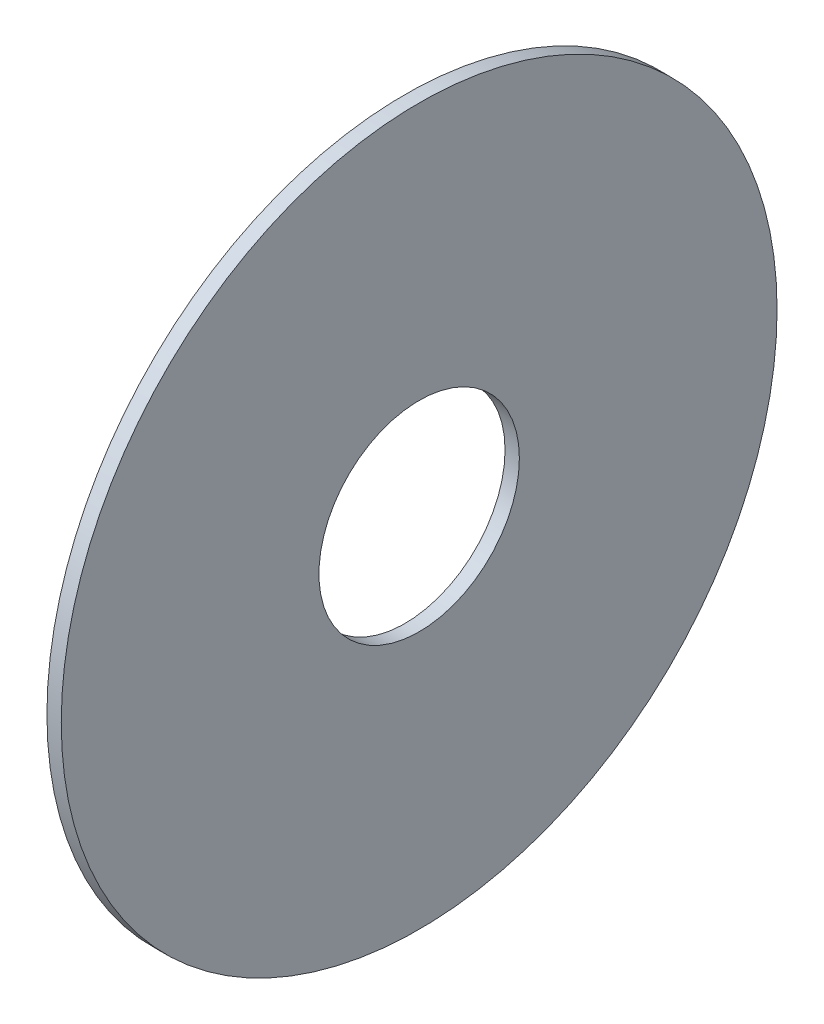
ISO-10303-21;
HEADER;
FILE_DESCRIPTION(('STEP AP214'),'2;1');
FILE_NAME('part.step','',(''),(''),'','','');
FILE_SCHEMA(('AUTOMOTIVE_DESIGN { 1 0 10303 214 1 1 1 1 }'));
ENDSEC;
DATA;
#1=APPLICATION_CONTEXT('core data for automotive mechanical design processes');
#2=APPLICATION_PROTOCOL_DEFINITION('international standard','automotive_design',2000,#1);
#3=PRODUCT_CONTEXT('',#1,'mechanical');
#4=PRODUCT('Part','Part','',(#3));
#5=PRODUCT_RELATED_PRODUCT_CATEGORY('part','',(#4));
#6=PRODUCT_DEFINITION_FORMATION('','',#4);
#7=PRODUCT_DEFINITION_CONTEXT('part definition',#1,'design');
#8=PRODUCT_DEFINITION('design','',#6,#7);
#9=PRODUCT_DEFINITION_SHAPE('','',#8);
#10=(LENGTH_UNIT() NAMED_UNIT(*) SI_UNIT(.MILLI.,.METRE.));
#11=(NAMED_UNIT(*) PLANE_ANGLE_UNIT() SI_UNIT($,.RADIAN.));
#12=(NAMED_UNIT(*) SI_UNIT($,.STERADIAN.) SOLID_ANGLE_UNIT());
#13=UNCERTAINTY_MEASURE_WITH_UNIT(LENGTH_MEASURE(1.E-05),#10,'distance_accuracy_value','');
#14=(GEOMETRIC_REPRESENTATION_CONTEXT(3) GLOBAL_UNCERTAINTY_ASSIGNED_CONTEXT((#13)) GLOBAL_UNIT_ASSIGNED_CONTEXT((#10,
#11,#12)) REPRESENTATION_CONTEXT('',''));
#15=CARTESIAN_POINT('',(0.,0.,0.));
#16=DIRECTION('',(0.,0.,1.));
#17=DIRECTION('',(1.,0.,0.));
#18=AXIS2_PLACEMENT_3D('',#15,#16,#17);
#19=CARTESIAN_POINT('',(0.762,0.,0.));
#20=DIRECTION('',(1.,0.,0.));
#21=DIRECTION('',(0.,0.,-1.));
#22=AXIS2_PLACEMENT_3D('',#19,#20,#21);
#23=PLANE('',#22);
#24=CARTESIAN_POINT('',(0.762,0.,0.));
#25=DIRECTION('',(1.,0.,0.));
#26=DIRECTION('',(0.,0.,-1.));
#27=AXIS2_PLACEMENT_3D('',#24,#25,#26);
#28=CIRCLE('',#27,19.05);
#29=CARTESIAN_POINT('',(0.762,0.,-19.05));
#30=VERTEX_POINT('',#29);
#31=EDGE_CURVE('E10',#30,#30,#28,.T.);
#32=ORIENTED_EDGE('',*,*,#31,.T.);
#33=EDGE_LOOP('',(#32));
#34=FACE_BOUND('',#33,.T.);
#35=CARTESIAN_POINT('',(0.762,0.,0.));
#36=DIRECTION('',(1.,0.,0.));
#37=DIRECTION('',(0.,0.,-1.));
#38=AXIS2_PLACEMENT_3D('',#35,#36,#37);
#39=CIRCLE('',#38,5.334);
#40=CARTESIAN_POINT('',(0.762,0.,-5.334));
#41=VERTEX_POINT('',#40);
#42=EDGE_CURVE('E42',#41,#41,#39,.T.);
#43=ORIENTED_EDGE('',*,*,#42,.F.);
#44=EDGE_LOOP('',(#43));
#45=FACE_BOUND('',#44,.T.);
#46=ADVANCED_FACE('F31',(#34,#45),#23,.T.);
#47=CARTESIAN_POINT('',(0.,0.,0.));
#48=DIRECTION('',(1.,0.,0.));
#49=DIRECTION('',(0.,0.,-1.));
#50=AXIS2_PLACEMENT_3D('',#47,#48,#49);
#51=PLANE('',#50);
#52=CARTESIAN_POINT('',(0.,0.,0.));
#53=DIRECTION('',(1.,0.,0.));
#54=DIRECTION('',(0.,0.,-1.));
#55=AXIS2_PLACEMENT_3D('',#52,#53,#54);
#56=CIRCLE('',#55,19.05);
#57=CARTESIAN_POINT('',(0.,0.,-19.05));
#58=VERTEX_POINT('',#57);
#59=EDGE_CURVE('E35',#58,#58,#56,.T.);
#60=ORIENTED_EDGE('',*,*,#59,.F.);
#61=EDGE_LOOP('',(#60));
#62=FACE_BOUND('',#61,.T.);
#63=CARTESIAN_POINT('',(0.,0.,0.));
#64=DIRECTION('',(1.,0.,0.));
#65=DIRECTION('',(0.,0.,-1.));
#66=AXIS2_PLACEMENT_3D('',#63,#64,#65);
#67=CIRCLE('',#66,5.334);
#68=CARTESIAN_POINT('',(0.,0.,-5.334));
#69=VERTEX_POINT('',#68);
#70=EDGE_CURVE('E44',#69,#69,#67,.T.);
#71=ORIENTED_EDGE('',*,*,#70,.T.);
#72=EDGE_LOOP('',(#71));
#73=FACE_BOUND('',#72,.T.);
#74=ADVANCED_FACE('F54',(#62,#73),#51,.F.);
#75=CARTESIAN_POINT('',(0.762,0.,0.));
#76=DIRECTION('',(-1.,0.,0.));
#77=DIRECTION('',(0.,0.,1.));
#78=AXIS2_PLACEMENT_3D('',#75,#76,#77);
#79=CYLINDRICAL_SURFACE('',#78,19.05);
#80=ORIENTED_EDGE('',*,*,#31,.F.);
#81=EDGE_LOOP('',(#80));
#82=FACE_BOUND('',#81,.T.);
#83=ORIENTED_EDGE('',*,*,#59,.T.);
#84=EDGE_LOOP('',(#83));
#85=FACE_BOUND('',#84,.T.);
#86=ADVANCED_FACE('F33',(#82,#85),#79,.T.);
#87=CARTESIAN_POINT('',(0.762,0.,0.));
#88=DIRECTION('',(-1.,0.,0.));
#89=DIRECTION('',(0.,0.,1.));
#90=AXIS2_PLACEMENT_3D('',#87,#88,#89);
#91=CYLINDRICAL_SURFACE('',#90,5.334);
#92=ORIENTED_EDGE('',*,*,#42,.T.);
#93=EDGE_LOOP('',(#92));
#94=FACE_BOUND('',#93,.T.);
#95=ORIENTED_EDGE('',*,*,#70,.F.);
#96=EDGE_LOOP('',(#95));
#97=FACE_BOUND('',#96,.T.);
#98=ADVANCED_FACE('F50',(#94,#97),#91,.F.);
#99=CLOSED_SHELL('',(#46,#74,#86,#98));
#100=MANIFOLD_SOLID_BREP('B2',#99);
#101=ADVANCED_BREP_SHAPE_REPRESENTATION('',(#18,#100),#14);
#102=SHAPE_DEFINITION_REPRESENTATION(#9,#101);
ENDSEC;
END-ISO-10303-21;
